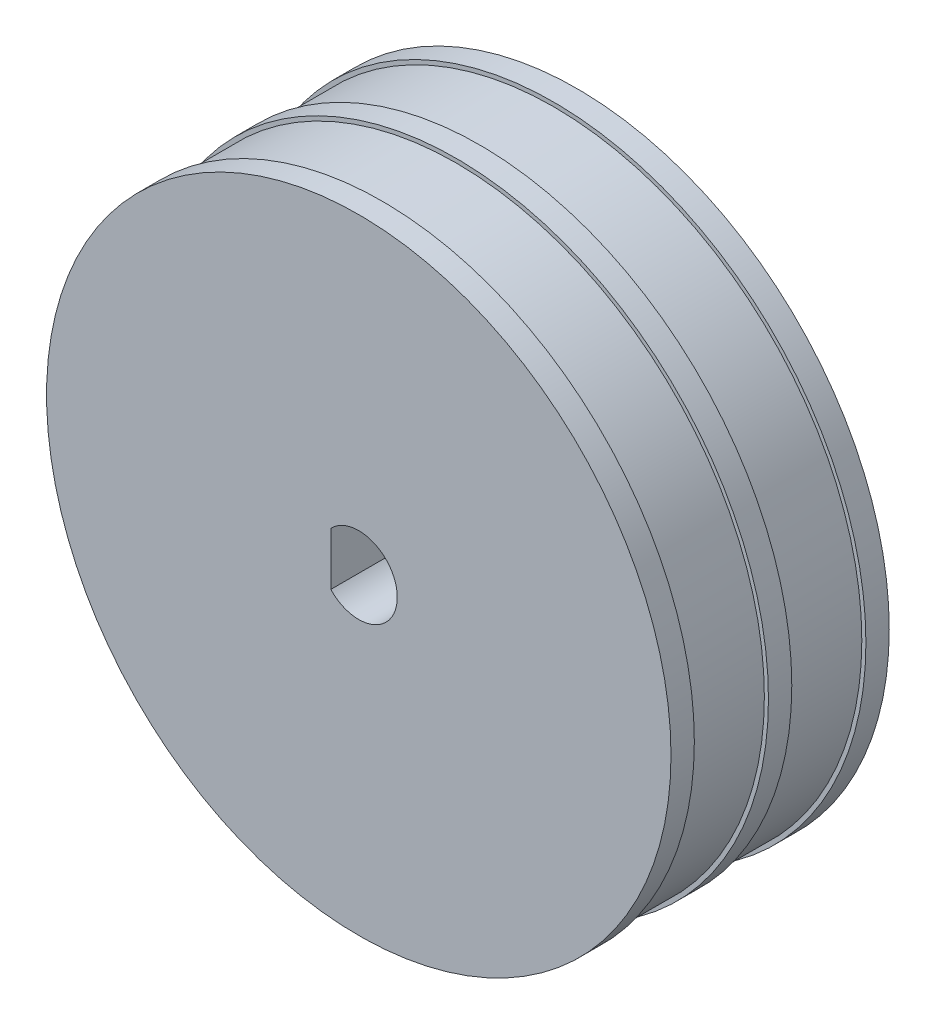
ISO-10303-21;
HEADER;
FILE_DESCRIPTION(('STEP AP214'),'2;1');
FILE_NAME('part.step','',(''),(''),'','','');
FILE_SCHEMA(('AUTOMOTIVE_DESIGN { 1 0 10303 214 1 1 1 1 }'));
ENDSEC;
DATA;
#1=APPLICATION_CONTEXT('core data for automotive mechanical design processes');
#2=APPLICATION_PROTOCOL_DEFINITION('international standard','automotive_design',2000,#1);
#3=PRODUCT_CONTEXT('',#1,'mechanical');
#4=PRODUCT('Part','Part','',(#3));
#5=PRODUCT_RELATED_PRODUCT_CATEGORY('part','',(#4));
#6=PRODUCT_DEFINITION_FORMATION('','',#4);
#7=PRODUCT_DEFINITION_CONTEXT('part definition',#1,'design');
#8=PRODUCT_DEFINITION('design','',#6,#7);
#9=PRODUCT_DEFINITION_SHAPE('','',#8);
#10=(LENGTH_UNIT() NAMED_UNIT(*) SI_UNIT(.MILLI.,.METRE.));
#11=(NAMED_UNIT(*) PLANE_ANGLE_UNIT() SI_UNIT($,.RADIAN.));
#12=(NAMED_UNIT(*) SI_UNIT($,.STERADIAN.) SOLID_ANGLE_UNIT());
#13=UNCERTAINTY_MEASURE_WITH_UNIT(LENGTH_MEASURE(1.E-05),#10,'distance_accuracy_value','');
#14=(GEOMETRIC_REPRESENTATION_CONTEXT(3) GLOBAL_UNCERTAINTY_ASSIGNED_CONTEXT((#13)) GLOBAL_UNIT_ASSIGNED_CONTEXT((#10,
#11,#12)) REPRESENTATION_CONTEXT('',''));
#15=CARTESIAN_POINT('',(0.,0.,0.));
#16=DIRECTION('',(0.,0.,1.));
#17=DIRECTION('',(1.,0.,0.));
#18=AXIS2_PLACEMENT_3D('',#15,#16,#17);
#19=CARTESIAN_POINT('',(0.,0.,1.));
#20=DIRECTION('',(0.,0.,-1.));
#21=DIRECTION('',(-1.,0.,0.));
#22=AXIS2_PLACEMENT_3D('',#19,#20,#21);
#23=CYLINDRICAL_SURFACE('',#22,13.375);
#24=CARTESIAN_POINT('',(0.,0.,1.));
#25=DIRECTION('',(0.,0.,1.));
#26=DIRECTION('',(1.,0.,0.));
#27=AXIS2_PLACEMENT_3D('',#24,#25,#26);
#28=CIRCLE('',#27,13.375);
#29=CARTESIAN_POINT('',(13.375,0.,1.));
#30=VERTEX_POINT('',#29);
#31=EDGE_CURVE('E119',#30,#30,#28,.T.);
#32=ORIENTED_EDGE('',*,*,#31,.F.);
#33=EDGE_LOOP('',(#32));
#34=FACE_BOUND('',#33,.T.);
#35=CARTESIAN_POINT('',(0.,0.,0.));
#36=DIRECTION('',(0.,0.,1.));
#37=DIRECTION('',(1.,0.,0.));
#38=AXIS2_PLACEMENT_3D('',#35,#36,#37);
#39=CIRCLE('',#38,13.375);
#40=CARTESIAN_POINT('',(13.375,0.,0.));
#41=VERTEX_POINT('',#40);
#42=EDGE_CURVE('E44',#41,#41,#39,.T.);
#43=ORIENTED_EDGE('',*,*,#42,.T.);
#44=EDGE_LOOP('',(#43));
#45=FACE_BOUND('',#44,.T.);
#46=ADVANCED_FACE('F41',(#34,#45),#23,.T.);
#47=CARTESIAN_POINT('',(0.,0.,1.));
#48=DIRECTION('',(0.,0.,1.));
#49=DIRECTION('',(1.,0.,0.));
#50=AXIS2_PLACEMENT_3D('',#47,#48,#49);
#51=PLANE('',#50);
#52=CARTESIAN_POINT('',(0.,0.,1.));
#53=DIRECTION('',(0.,0.,1.));
#54=DIRECTION('',(1.,0.,0.));
#55=AXIS2_PLACEMENT_3D('',#52,#53,#54);
#56=CIRCLE('',#55,13.2);
#57=CARTESIAN_POINT('',(13.2,0.,1.));
#58=VERTEX_POINT('',#57);
#59=EDGE_CURVE('E50',#58,#58,#56,.T.);
#60=ORIENTED_EDGE('',*,*,#59,.F.);
#61=EDGE_LOOP('',(#60));
#62=FACE_BOUND('',#61,.T.);
#63=ORIENTED_EDGE('',*,*,#31,.T.);
#64=EDGE_LOOP('',(#63));
#65=FACE_BOUND('',#64,.T.);
#66=ADVANCED_FACE('F130',(#62,#65),#51,.T.);
#67=CARTESIAN_POINT('',(0.,0.,0.));
#68=DIRECTION('',(0.,0.,1.));
#69=DIRECTION('',(1.,0.,0.));
#70=AXIS2_PLACEMENT_3D('',#67,#68,#69);
#71=PLANE('',#70);
#72=DIRECTION('',(0.,1.,0.));
#73=VECTOR('',#72,1.);
#74=CARTESIAN_POINT('',(-1.2,1.13247516529061,0.));
#75=LINE('',#74,#73);
#76=CARTESIAN_POINT('',(-1.2,-1.13247516529061,0.));
#77=VERTEX_POINT('',#76);
#78=CARTESIAN_POINT('',(-1.2,1.13247516529061,0.));
#79=VERTEX_POINT('',#78);
#80=EDGE_CURVE('E79',#77,#79,#75,.T.);
#81=ORIENTED_EDGE('',*,*,#80,.F.);
#82=CARTESIAN_POINT('',(0.,0.,0.));
#83=DIRECTION('',(0.,0.,-1.));
#84=DIRECTION('',(-1.,0.,0.));
#85=AXIS2_PLACEMENT_3D('',#82,#83,#84);
#86=CIRCLE('',#85,1.65);
#87=EDGE_CURVE('E58',#79,#77,#86,.T.);
#88=ORIENTED_EDGE('',*,*,#87,.F.);
#89=EDGE_LOOP('',(#81,#88));
#90=FACE_BOUND('',#89,.T.);
#91=ORIENTED_EDGE('',*,*,#42,.F.);
#92=EDGE_LOOP('',(#91));
#93=FACE_BOUND('',#92,.T.);
#94=ADVANCED_FACE('F84',(#90,#93),#71,.F.);
#95=CARTESIAN_POINT('',(0.,0.,4.175));
#96=DIRECTION('',(0.,0.,-1.));
#97=DIRECTION('',(-1.,0.,0.));
#98=AXIS2_PLACEMENT_3D('',#95,#96,#97);
#99=CYLINDRICAL_SURFACE('',#98,13.2);
#100=CARTESIAN_POINT('',(0.,0.,4.175));
#101=DIRECTION('',(0.,0.,1.));
#102=DIRECTION('',(1.,0.,0.));
#103=AXIS2_PLACEMENT_3D('',#100,#101,#102);
#104=CIRCLE('',#103,13.2);
#105=CARTESIAN_POINT('',(13.2,0.,4.175));
#106=VERTEX_POINT('',#105);
#107=EDGE_CURVE('E110',#106,#106,#104,.T.);
#108=ORIENTED_EDGE('',*,*,#107,.F.);
#109=EDGE_LOOP('',(#108));
#110=FACE_BOUND('',#109,.T.);
#111=ORIENTED_EDGE('',*,*,#59,.T.);
#112=EDGE_LOOP('',(#111));
#113=FACE_BOUND('',#112,.T.);
#114=ADVANCED_FACE('F129',(#110,#113),#99,.T.);
#115=CARTESIAN_POINT('',(0.,0.,5.175));
#116=DIRECTION('',(0.,0.,-1.));
#117=DIRECTION('',(-1.,0.,0.));
#118=AXIS2_PLACEMENT_3D('',#115,#116,#117);
#119=CYLINDRICAL_SURFACE('',#118,13.375);
#120=CARTESIAN_POINT('',(0.,0.,5.175));
#121=DIRECTION('',(0.,0.,1.));
#122=DIRECTION('',(1.,0.,0.));
#123=AXIS2_PLACEMENT_3D('',#120,#121,#122);
#124=CIRCLE('',#123,13.375);
#125=CARTESIAN_POINT('',(13.375,0.,5.175));
#126=VERTEX_POINT('',#125);
#127=EDGE_CURVE('E106',#126,#126,#124,.T.);
#128=ORIENTED_EDGE('',*,*,#127,.F.);
#129=EDGE_LOOP('',(#128));
#130=FACE_BOUND('',#129,.T.);
#131=CARTESIAN_POINT('',(0.,0.,4.175));
#132=DIRECTION('',(0.,0.,1.));
#133=DIRECTION('',(1.,0.,0.));
#134=AXIS2_PLACEMENT_3D('',#131,#132,#133);
#135=CIRCLE('',#134,13.375);
#136=CARTESIAN_POINT('',(13.375,0.,4.175));
#137=VERTEX_POINT('',#136);
#138=EDGE_CURVE('E104',#137,#137,#135,.T.);
#139=ORIENTED_EDGE('',*,*,#138,.T.);
#140=EDGE_LOOP('',(#139));
#141=FACE_BOUND('',#140,.T.);
#142=ADVANCED_FACE('F135',(#130,#141),#119,.T.);
#143=CARTESIAN_POINT('',(0.,0.,5.175));
#144=DIRECTION('',(0.,0.,1.));
#145=DIRECTION('',(1.,0.,0.));
#146=AXIS2_PLACEMENT_3D('',#143,#144,#145);
#147=PLANE('',#146);
#148=CARTESIAN_POINT('',(0.,0.,5.175));
#149=DIRECTION('',(0.,0.,1.));
#150=DIRECTION('',(1.,0.,0.));
#151=AXIS2_PLACEMENT_3D('',#148,#149,#150);
#152=CIRCLE('',#151,13.2);
#153=CARTESIAN_POINT('',(13.2,0.,5.175));
#154=VERTEX_POINT('',#153);
#155=EDGE_CURVE('E11',#154,#154,#152,.T.);
#156=ORIENTED_EDGE('',*,*,#155,.F.);
#157=EDGE_LOOP('',(#156));
#158=FACE_BOUND('',#157,.T.);
#159=ORIENTED_EDGE('',*,*,#127,.T.);
#160=EDGE_LOOP('',(#159));
#161=FACE_BOUND('',#160,.T.);
#162=ADVANCED_FACE('F164',(#158,#161),#147,.T.);
#163=CARTESIAN_POINT('',(0.,0.,4.175));
#164=DIRECTION('',(0.,0.,1.));
#165=DIRECTION('',(1.,0.,0.));
#166=AXIS2_PLACEMENT_3D('',#163,#164,#165);
#167=PLANE('',#166);
#168=ORIENTED_EDGE('',*,*,#107,.T.);
#169=EDGE_LOOP('',(#168));
#170=FACE_BOUND('',#169,.T.);
#171=ORIENTED_EDGE('',*,*,#138,.F.);
#172=EDGE_LOOP('',(#171));
#173=FACE_BOUND('',#172,.T.);
#174=ADVANCED_FACE('F172',(#170,#173),#167,.F.);
#175=CARTESIAN_POINT('',(0.,0.,8.35));
#176=DIRECTION('',(0.,0.,-1.));
#177=DIRECTION('',(-1.,0.,0.));
#178=AXIS2_PLACEMENT_3D('',#175,#176,#177);
#179=CYLINDRICAL_SURFACE('',#178,13.2);
#180=CARTESIAN_POINT('',(0.,0.,8.35));
#181=DIRECTION('',(0.,0.,1.));
#182=DIRECTION('',(1.,0.,0.));
#183=AXIS2_PLACEMENT_3D('',#180,#181,#182);
#184=CIRCLE('',#183,13.2);
#185=CARTESIAN_POINT('',(13.2,0.,8.35));
#186=VERTEX_POINT('',#185);
#187=EDGE_CURVE('E98',#186,#186,#184,.T.);
#188=ORIENTED_EDGE('',*,*,#187,.F.);
#189=EDGE_LOOP('',(#188));
#190=FACE_BOUND('',#189,.T.);
#191=ORIENTED_EDGE('',*,*,#155,.T.);
#192=EDGE_LOOP('',(#191));
#193=FACE_BOUND('',#192,.T.);
#194=ADVANCED_FACE('F177',(#190,#193),#179,.T.);
#195=CARTESIAN_POINT('',(0.,0.,9.35));
#196=DIRECTION('',(0.,0.,-1.));
#197=DIRECTION('',(-1.,0.,0.));
#198=AXIS2_PLACEMENT_3D('',#195,#196,#197);
#199=CYLINDRICAL_SURFACE('',#198,13.375);
#200=CARTESIAN_POINT('',(0.,0.,9.35));
#201=DIRECTION('',(0.,0.,1.));
#202=DIRECTION('',(1.,0.,0.));
#203=AXIS2_PLACEMENT_3D('',#200,#201,#202);
#204=CIRCLE('',#203,13.375);
#205=CARTESIAN_POINT('',(13.375,0.,9.35));
#206=VERTEX_POINT('',#205);
#207=EDGE_CURVE('E94',#206,#206,#204,.T.);
#208=ORIENTED_EDGE('',*,*,#207,.F.);
#209=EDGE_LOOP('',(#208));
#210=FACE_BOUND('',#209,.T.);
#211=CARTESIAN_POINT('',(0.,0.,8.35));
#212=DIRECTION('',(0.,0.,1.));
#213=DIRECTION('',(1.,0.,0.));
#214=AXIS2_PLACEMENT_3D('',#211,#212,#213);
#215=CIRCLE('',#214,13.375);
#216=CARTESIAN_POINT('',(13.375,0.,8.35));
#217=VERTEX_POINT('',#216);
#218=EDGE_CURVE('E75',#217,#217,#215,.T.);
#219=ORIENTED_EDGE('',*,*,#218,.T.);
#220=EDGE_LOOP('',(#219));
#221=FACE_BOUND('',#220,.T.);
#222=ADVANCED_FACE('F194',(#210,#221),#199,.T.);
#223=CARTESIAN_POINT('',(0.,0.,9.35));
#224=DIRECTION('',(0.,0.,1.));
#225=DIRECTION('',(1.,0.,0.));
#226=AXIS2_PLACEMENT_3D('',#223,#224,#225);
#227=PLANE('',#226);
#228=CARTESIAN_POINT('',(0.,0.,9.35));
#229=DIRECTION('',(0.,0.,-1.));
#230=DIRECTION('',(-1.,0.,0.));
#231=AXIS2_PLACEMENT_3D('',#228,#229,#230);
#232=CIRCLE('',#231,1.65);
#233=CARTESIAN_POINT('',(-1.2,1.13247516529061,9.35));
#234=VERTEX_POINT('',#233);
#235=CARTESIAN_POINT('',(-1.2,-1.13247516529061,9.35));
#236=VERTEX_POINT('',#235);
#237=EDGE_CURVE('E63',#234,#236,#232,.T.);
#238=ORIENTED_EDGE('',*,*,#237,.T.);
#239=DIRECTION('',(0.,1.,0.));
#240=VECTOR('',#239,1.);
#241=CARTESIAN_POINT('',(-1.2,1.13247516529061,9.35));
#242=LINE('',#241,#240);
#243=EDGE_CURVE('E89',#236,#234,#242,.T.);
#244=ORIENTED_EDGE('',*,*,#243,.T.);
#245=EDGE_LOOP('',(#238,#244));
#246=FACE_BOUND('',#245,.T.);
#247=ORIENTED_EDGE('',*,*,#207,.T.);
#248=EDGE_LOOP('',(#247));
#249=FACE_BOUND('',#248,.T.);
#250=ADVANCED_FACE('F204',(#246,#249),#227,.T.);
#251=CARTESIAN_POINT('',(0.,0.,8.35));
#252=DIRECTION('',(0.,0.,1.));
#253=DIRECTION('',(1.,0.,0.));
#254=AXIS2_PLACEMENT_3D('',#251,#252,#253);
#255=PLANE('',#254);
#256=ORIENTED_EDGE('',*,*,#187,.T.);
#257=EDGE_LOOP('',(#256));
#258=FACE_BOUND('',#257,.T.);
#259=ORIENTED_EDGE('',*,*,#218,.F.);
#260=EDGE_LOOP('',(#259));
#261=FACE_BOUND('',#260,.T.);
#262=ADVANCED_FACE('F212',(#258,#261),#255,.F.);
#263=CARTESIAN_POINT('',(0.,0.,9.35));
#264=DIRECTION('',(0.,0.,-1.));
#265=DIRECTION('',(-1.,0.,0.));
#266=AXIS2_PLACEMENT_3D('',#263,#264,#265);
#267=CYLINDRICAL_SURFACE('',#266,1.65);
#268=ORIENTED_EDGE('',*,*,#87,.T.);
#269=DIRECTION('',(0.,0.,-1.));
#270=VECTOR('',#269,1.);
#271=CARTESIAN_POINT('',(-1.2,-1.13247516529061,9.35));
#272=LINE('',#271,#270);
#273=EDGE_CURVE('E76',#236,#77,#272,.T.);
#274=ORIENTED_EDGE('',*,*,#273,.F.);
#275=ORIENTED_EDGE('',*,*,#237,.F.);
#276=DIRECTION('',(0.,0.,-1.));
#277=VECTOR('',#276,1.);
#278=CARTESIAN_POINT('',(-1.2,1.13247516529061,9.35));
#279=LINE('',#278,#277);
#280=EDGE_CURVE('E68',#234,#79,#279,.T.);
#281=ORIENTED_EDGE('',*,*,#280,.T.);
#282=EDGE_LOOP('',(#268,#274,#275,#281));
#283=FACE_BOUND('',#282,.T.);
#284=ADVANCED_FACE('F70',(#283),#267,.F.);
#285=CARTESIAN_POINT('',(-1.2,1.13247516529061,9.35));
#286=DIRECTION('',(-1.,0.,0.));
#287=DIRECTION('',(0.,-1.,0.));
#288=AXIS2_PLACEMENT_3D('',#285,#286,#287);
#289=PLANE('',#288);
#290=ORIENTED_EDGE('',*,*,#80,.T.);
#291=ORIENTED_EDGE('',*,*,#280,.F.);
#292=ORIENTED_EDGE('',*,*,#243,.F.);
#293=ORIENTED_EDGE('',*,*,#273,.T.);
#294=EDGE_LOOP('',(#290,#291,#292,#293));
#295=FACE_BOUND('',#294,.T.);
#296=ADVANCED_FACE('F80',(#295),#289,.F.);
#297=CLOSED_SHELL('',(#46,#66,#94,#114,#142,#162,#174,#194,#222,#250,#262,#284,#296));
#298=MANIFOLD_SOLID_BREP('B2',#297);
#299=ADVANCED_BREP_SHAPE_REPRESENTATION('',(#18,#298),#14);
#300=SHAPE_DEFINITION_REPRESENTATION(#9,#299);
ENDSEC;
END-ISO-10303-21;
